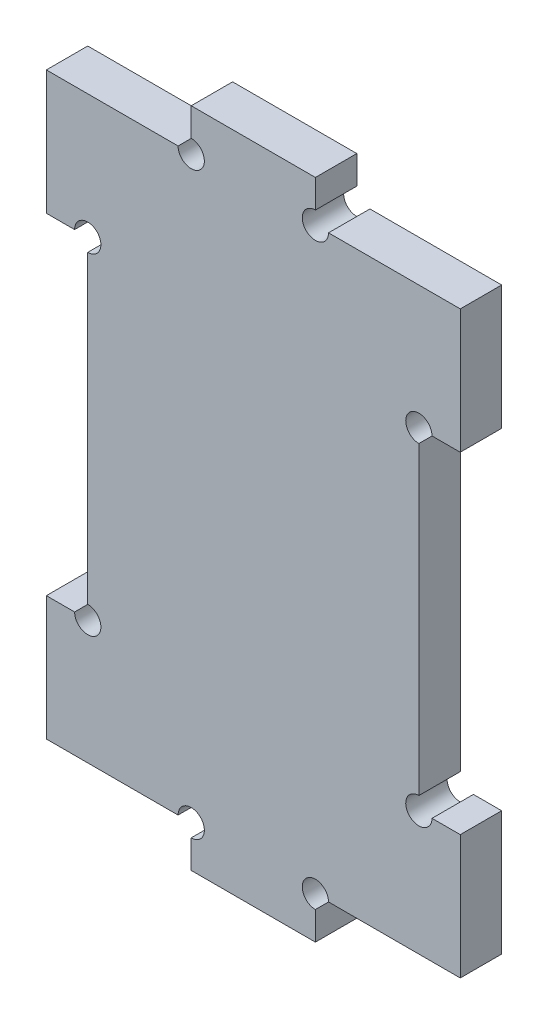
ISO-10303-21;
HEADER;
FILE_DESCRIPTION(('STEP AP214'),'2;1');
FILE_NAME('part.step','',(''),(''),'','','');
FILE_SCHEMA(('AUTOMOTIVE_DESIGN { 1 0 10303 214 1 1 1 1 }'));
ENDSEC;
DATA;
#1=APPLICATION_CONTEXT('core data for automotive mechanical design processes');
#2=APPLICATION_PROTOCOL_DEFINITION('international standard','automotive_design',2000,#1);
#3=PRODUCT_CONTEXT('',#1,'mechanical');
#4=PRODUCT('Part','Part','',(#3));
#5=PRODUCT_RELATED_PRODUCT_CATEGORY('part','',(#4));
#6=PRODUCT_DEFINITION_FORMATION('','',#4);
#7=PRODUCT_DEFINITION_CONTEXT('part definition',#1,'design');
#8=PRODUCT_DEFINITION('design','',#6,#7);
#9=PRODUCT_DEFINITION_SHAPE('','',#8);
#10=(LENGTH_UNIT() NAMED_UNIT(*) SI_UNIT(.MILLI.,.METRE.));
#11=(NAMED_UNIT(*) PLANE_ANGLE_UNIT() SI_UNIT($,.RADIAN.));
#12=(NAMED_UNIT(*) SI_UNIT($,.STERADIAN.) SOLID_ANGLE_UNIT());
#13=UNCERTAINTY_MEASURE_WITH_UNIT(LENGTH_MEASURE(1.E-05),#10,'distance_accuracy_value','');
#14=(GEOMETRIC_REPRESENTATION_CONTEXT(3) GLOBAL_UNCERTAINTY_ASSIGNED_CONTEXT((#13)) GLOBAL_UNIT_ASSIGNED_CONTEXT((#10,
#11,#12)) REPRESENTATION_CONTEXT('',''));
#15=CARTESIAN_POINT('',(0.,0.,0.));
#16=DIRECTION('',(0.,0.,1.));
#17=DIRECTION('',(1.,0.,0.));
#18=AXIS2_PLACEMENT_3D('',#15,#16,#17);
#19=CARTESIAN_POINT('',(25.,35.,5.));
#20=DIRECTION('',(-1.,0.,0.));
#21=DIRECTION('',(0.,0.,1.));
#22=AXIS2_PLACEMENT_3D('',#19,#20,#21);
#23=PLANE('',#22);
#24=DIRECTION('',(0.,0.,1.));
#25=VECTOR('',#24,1.);
#26=CARTESIAN_POINT('',(25.,-20.,0.));
#27=LINE('',#26,#25);
#28=CARTESIAN_POINT('',(25.,-20.,0.));
#29=VERTEX_POINT('',#28);
#30=CARTESIAN_POINT('',(25.,-20.,5.));
#31=VERTEX_POINT('',#30);
#32=EDGE_CURVE('E258',#29,#31,#27,.T.);
#33=ORIENTED_EDGE('',*,*,#32,.T.);
#34=DIRECTION('',(0.,1.,0.));
#35=VECTOR('',#34,1.);
#36=CARTESIAN_POINT('',(25.,35.,5.));
#37=LINE('',#36,#35);
#38=CARTESIAN_POINT('',(25.,-35.,5.));
#39=VERTEX_POINT('',#38);
#40=EDGE_CURVE('E311',#39,#31,#37,.T.);
#41=ORIENTED_EDGE('',*,*,#40,.F.);
#42=DIRECTION('',(0.,0.,-1.));
#43=VECTOR('',#42,1.);
#44=CARTESIAN_POINT('',(25.,-35.,5.));
#45=LINE('',#44,#43);
#46=CARTESIAN_POINT('',(25.,-35.,0.));
#47=VERTEX_POINT('',#46);
#48=EDGE_CURVE('E350',#39,#47,#45,.T.);
#49=ORIENTED_EDGE('',*,*,#48,.T.);
#50=DIRECTION('',(0.,1.,0.));
#51=VECTOR('',#50,1.);
#52=CARTESIAN_POINT('',(25.,35.,0.));
#53=LINE('',#52,#51);
#54=EDGE_CURVE('E343',#47,#29,#53,.T.);
#55=ORIENTED_EDGE('',*,*,#54,.T.);
#56=EDGE_LOOP('',(#33,#41,#49,#55));
#57=FACE_BOUND('',#56,.T.);
#58=ADVANCED_FACE('F33',(#57),#23,.F.);
#59=DIRECTION('',(0.,0.,1.));
#60=VECTOR('',#59,1.);
#61=CARTESIAN_POINT('',(25.,20.,0.));
#62=LINE('',#61,#60);
#63=CARTESIAN_POINT('',(25.,20.,0.));
#64=VERTEX_POINT('',#63);
#65=CARTESIAN_POINT('',(25.,20.,5.));
#66=VERTEX_POINT('',#65);
#67=EDGE_CURVE('E242',#64,#66,#62,.T.);
#68=ORIENTED_EDGE('',*,*,#67,.F.);
#69=CARTESIAN_POINT('',(25.,35.,0.));
#70=VERTEX_POINT('',#69);
#71=EDGE_CURVE('E342',#64,#70,#53,.T.);
#72=ORIENTED_EDGE('',*,*,#71,.T.);
#73=DIRECTION('',(0.,0.,-1.));
#74=VECTOR('',#73,1.);
#75=CARTESIAN_POINT('',(25.,35.,5.));
#76=LINE('',#75,#74);
#77=CARTESIAN_POINT('',(25.,35.,5.));
#78=VERTEX_POINT('',#77);
#79=EDGE_CURVE('E317',#78,#70,#76,.T.);
#80=ORIENTED_EDGE('',*,*,#79,.F.);
#81=EDGE_CURVE('E310',#66,#78,#37,.T.);
#82=ORIENTED_EDGE('',*,*,#81,.F.);
#83=EDGE_LOOP('',(#68,#72,#80,#82));
#84=FACE_BOUND('',#83,.T.);
#85=ADVANCED_FACE('F488',(#84),#23,.F.);
#86=CARTESIAN_POINT('',(0.,0.,5.));
#87=DIRECTION('',(0.,0.,1.));
#88=DIRECTION('',(1.,0.,0.));
#89=AXIS2_PLACEMENT_3D('',#86,#87,#88);
#90=PLANE('',#89);
#91=CARTESIAN_POINT('',(7.5,35.,5.));
#92=DIRECTION('',(0.,0.,1.));
#93=DIRECTION('',(1.,0.,0.));
#94=AXIS2_PLACEMENT_3D('',#91,#92,#93);
#95=CIRCLE('',#94,1.5875);
#96=CARTESIAN_POINT('',(7.5,36.5875,5.));
#97=VERTEX_POINT('',#96);
#98=CARTESIAN_POINT('',(9.0875,35.,5.));
#99=VERTEX_POINT('',#98);
#100=EDGE_CURVE('E426',#97,#99,#95,.T.);
#101=ORIENTED_EDGE('',*,*,#100,.F.);
#102=DIRECTION('',(0.,1.,0.));
#103=VECTOR('',#102,1.);
#104=CARTESIAN_POINT('',(7.5,40.,5.));
#105=LINE('',#104,#103);
#106=CARTESIAN_POINT('',(7.5,40.,5.));
#107=VERTEX_POINT('',#106);
#108=EDGE_CURVE('E284',#97,#107,#105,.T.);
#109=ORIENTED_EDGE('',*,*,#108,.T.);
#110=DIRECTION('',(-1.,0.,0.));
#111=VECTOR('',#110,1.);
#112=CARTESIAN_POINT('',(-7.5,40.,5.));
#113=LINE('',#112,#111);
#114=CARTESIAN_POINT('',(-7.5,40.,5.));
#115=VERTEX_POINT('',#114);
#116=EDGE_CURVE('E286',#107,#115,#113,.T.);
#117=ORIENTED_EDGE('',*,*,#116,.T.);
#118=DIRECTION('',(0.,-1.,0.));
#119=VECTOR('',#118,1.);
#120=CARTESIAN_POINT('',(-7.5,40.,5.));
#121=LINE('',#120,#119);
#122=CARTESIAN_POINT('',(-7.5,36.5875,5.));
#123=VERTEX_POINT('',#122);
#124=EDGE_CURVE('E289',#115,#123,#121,.T.);
#125=ORIENTED_EDGE('',*,*,#124,.T.);
#126=CARTESIAN_POINT('',(-7.5,35.,5.));
#127=DIRECTION('',(0.,0.,1.));
#128=DIRECTION('',(1.,0.,0.));
#129=AXIS2_PLACEMENT_3D('',#126,#127,#128);
#130=CIRCLE('',#129,1.5875);
#131=CARTESIAN_POINT('',(-9.0875,35.,5.));
#132=VERTEX_POINT('',#131);
#133=EDGE_CURVE('E425',#132,#123,#130,.T.);
#134=ORIENTED_EDGE('',*,*,#133,.F.);
#135=DIRECTION('',(-1.,0.,0.));
#136=VECTOR('',#135,1.);
#137=CARTESIAN_POINT('',(-7.5,35.,5.));
#138=LINE('',#137,#136);
#139=CARTESIAN_POINT('',(-25.,35.,5.));
#140=VERTEX_POINT('',#139);
#141=EDGE_CURVE('E292',#132,#140,#138,.T.);
#142=ORIENTED_EDGE('',*,*,#141,.T.);
#143=DIRECTION('',(0.,-1.,0.));
#144=VECTOR('',#143,1.);
#145=CARTESIAN_POINT('',(-25.,35.,5.));
#146=LINE('',#145,#144);
#147=CARTESIAN_POINT('',(-25.,20.,5.));
#148=VERTEX_POINT('',#147);
#149=EDGE_CURVE('E295',#140,#148,#146,.T.);
#150=ORIENTED_EDGE('',*,*,#149,.T.);
#151=DIRECTION('',(-1.,0.,0.));
#152=VECTOR('',#151,1.);
#153=CARTESIAN_POINT('',(-20.,20.,5.));
#154=LINE('',#153,#152);
#155=CARTESIAN_POINT('',(-21.5875,20.,5.));
#156=VERTEX_POINT('',#155);
#157=EDGE_CURVE('E267',#156,#148,#154,.T.);
#158=ORIENTED_EDGE('',*,*,#157,.F.);
#159=CARTESIAN_POINT('',(-20.,20.,5.));
#160=DIRECTION('',(0.,0.,1.));
#161=DIRECTION('',(1.,0.,0.));
#162=AXIS2_PLACEMENT_3D('',#159,#160,#161);
#163=CIRCLE('',#162,1.5875);
#164=CARTESIAN_POINT('',(-20.,18.4125,5.));
#165=VERTEX_POINT('',#164);
#166=EDGE_CURVE('E431',#165,#156,#163,.T.);
#167=ORIENTED_EDGE('',*,*,#166,.F.);
#168=DIRECTION('',(0.,1.,0.));
#169=VECTOR('',#168,1.);
#170=CARTESIAN_POINT('',(-20.,-20.,5.));
#171=LINE('',#170,#169);
#172=CARTESIAN_POINT('',(-20.,-18.4125,5.));
#173=VERTEX_POINT('',#172);
#174=EDGE_CURVE('E275',#173,#165,#171,.T.);
#175=ORIENTED_EDGE('',*,*,#174,.F.);
#176=CARTESIAN_POINT('',(-20.,-20.,5.));
#177=DIRECTION('',(0.,0.,1.));
#178=DIRECTION('',(1.,0.,0.));
#179=AXIS2_PLACEMENT_3D('',#176,#177,#178);
#180=CIRCLE('',#179,1.5875);
#181=CARTESIAN_POINT('',(-21.5875,-20.,5.));
#182=VERTEX_POINT('',#181);
#183=EDGE_CURVE('E412',#182,#173,#180,.T.);
#184=ORIENTED_EDGE('',*,*,#183,.F.);
#185=DIRECTION('',(1.,0.,0.));
#186=VECTOR('',#185,1.);
#187=CARTESIAN_POINT('',(-20.,-20.,5.));
#188=LINE('',#187,#186);
#189=CARTESIAN_POINT('',(-25.,-20.,5.));
#190=VERTEX_POINT('',#189);
#191=EDGE_CURVE('E261',#190,#182,#188,.T.);
#192=ORIENTED_EDGE('',*,*,#191,.F.);
#193=CARTESIAN_POINT('',(-25.,-35.,5.));
#194=VERTEX_POINT('',#193);
#195=EDGE_CURVE('E294',#190,#194,#146,.T.);
#196=ORIENTED_EDGE('',*,*,#195,.T.);
#197=DIRECTION('',(1.,0.,0.));
#198=VECTOR('',#197,1.);
#199=CARTESIAN_POINT('',(-7.5,-35.,5.));
#200=LINE('',#199,#198);
#201=CARTESIAN_POINT('',(-9.0875,-35.,5.));
#202=VERTEX_POINT('',#201);
#203=EDGE_CURVE('E298',#194,#202,#200,.T.);
#204=ORIENTED_EDGE('',*,*,#203,.T.);
#205=CARTESIAN_POINT('',(-7.5,-35.,5.));
#206=DIRECTION('',(0.,0.,1.));
#207=DIRECTION('',(1.,0.,0.));
#208=AXIS2_PLACEMENT_3D('',#205,#206,#207);
#209=CIRCLE('',#208,1.5875);
#210=CARTESIAN_POINT('',(-7.5,-36.5875,5.));
#211=VERTEX_POINT('',#210);
#212=EDGE_CURVE('E407',#211,#202,#209,.T.);
#213=ORIENTED_EDGE('',*,*,#212,.F.);
#214=DIRECTION('',(0.,-1.,0.));
#215=VECTOR('',#214,1.);
#216=CARTESIAN_POINT('',(-7.5,-40.,5.));
#217=LINE('',#216,#215);
#218=CARTESIAN_POINT('',(-7.5,-40.,5.));
#219=VERTEX_POINT('',#218);
#220=EDGE_CURVE('E301',#211,#219,#217,.T.);
#221=ORIENTED_EDGE('',*,*,#220,.T.);
#222=DIRECTION('',(1.,0.,0.));
#223=VECTOR('',#222,1.);
#224=CARTESIAN_POINT('',(-7.5,-40.,5.));
#225=LINE('',#224,#223);
#226=CARTESIAN_POINT('',(7.5,-40.,5.));
#227=VERTEX_POINT('',#226);
#228=EDGE_CURVE('E303',#219,#227,#225,.T.);
#229=ORIENTED_EDGE('',*,*,#228,.T.);
#230=DIRECTION('',(0.,1.,0.));
#231=VECTOR('',#230,1.);
#232=CARTESIAN_POINT('',(7.5,-40.,5.));
#233=LINE('',#232,#231);
#234=CARTESIAN_POINT('',(7.5,-36.5875,5.));
#235=VERTEX_POINT('',#234);
#236=EDGE_CURVE('E305',#227,#235,#233,.T.);
#237=ORIENTED_EDGE('',*,*,#236,.T.);
#238=CARTESIAN_POINT('',(7.5,-35.,5.));
#239=DIRECTION('',(0.,0.,1.));
#240=DIRECTION('',(1.,0.,0.));
#241=AXIS2_PLACEMENT_3D('',#238,#239,#240);
#242=CIRCLE('',#241,1.5875);
#243=CARTESIAN_POINT('',(9.0875,-35.,5.));
#244=VERTEX_POINT('',#243);
#245=EDGE_CURVE('E405',#244,#235,#242,.T.);
#246=ORIENTED_EDGE('',*,*,#245,.F.);
#247=DIRECTION('',(1.,0.,0.));
#248=VECTOR('',#247,1.);
#249=CARTESIAN_POINT('',(7.5,-35.,5.));
#250=LINE('',#249,#248);
#251=EDGE_CURVE('E308',#244,#39,#250,.T.);
#252=ORIENTED_EDGE('',*,*,#251,.T.);
#253=ORIENTED_EDGE('',*,*,#40,.T.);
#254=DIRECTION('',(-1.,0.,0.));
#255=VECTOR('',#254,1.);
#256=CARTESIAN_POINT('',(20.,-20.,5.));
#257=LINE('',#256,#255);
#258=CARTESIAN_POINT('',(21.5875,-20.,5.));
#259=VERTEX_POINT('',#258);
#260=EDGE_CURVE('E246',#31,#259,#257,.T.);
#261=ORIENTED_EDGE('',*,*,#260,.T.);
#262=CARTESIAN_POINT('',(20.,-20.,5.));
#263=DIRECTION('',(0.,0.,1.));
#264=DIRECTION('',(1.,0.,0.));
#265=AXIS2_PLACEMENT_3D('',#262,#263,#264);
#266=CIRCLE('',#265,1.5875);
#267=CARTESIAN_POINT('',(20.,-18.4125,5.));
#268=VERTEX_POINT('',#267);
#269=EDGE_CURVE('E420',#268,#259,#266,.T.);
#270=ORIENTED_EDGE('',*,*,#269,.F.);
#271=DIRECTION('',(0.,1.,0.));
#272=VECTOR('',#271,1.);
#273=CARTESIAN_POINT('',(20.,-20.,5.));
#274=LINE('',#273,#272);
#275=CARTESIAN_POINT('',(20.,18.4125,5.));
#276=VERTEX_POINT('',#275);
#277=EDGE_CURVE('E237',#268,#276,#274,.T.);
#278=ORIENTED_EDGE('',*,*,#277,.T.);
#279=CARTESIAN_POINT('',(20.,20.,5.));
#280=DIRECTION('',(0.,0.,1.));
#281=DIRECTION('',(1.,0.,0.));
#282=AXIS2_PLACEMENT_3D('',#279,#280,#281);
#283=CIRCLE('',#282,1.5875);
#284=CARTESIAN_POINT('',(21.5875,20.,5.));
#285=VERTEX_POINT('',#284);
#286=EDGE_CURVE('E219',#285,#276,#283,.T.);
#287=ORIENTED_EDGE('',*,*,#286,.F.);
#288=DIRECTION('',(1.,0.,0.));
#289=VECTOR('',#288,1.);
#290=CARTESIAN_POINT('',(20.,20.,5.));
#291=LINE('',#290,#289);
#292=EDGE_CURVE('E233',#285,#66,#291,.T.);
#293=ORIENTED_EDGE('',*,*,#292,.T.);
#294=ORIENTED_EDGE('',*,*,#81,.T.);
#295=DIRECTION('',(-1.,0.,0.));
#296=VECTOR('',#295,1.);
#297=CARTESIAN_POINT('',(7.5,35.,5.));
#298=LINE('',#297,#296);
#299=EDGE_CURVE('E314',#78,#99,#298,.T.);
#300=ORIENTED_EDGE('',*,*,#299,.T.);
#301=EDGE_LOOP('',(#101,#109,#117,#125,#134,#142,#150,#158,#167,#175,#184,#192,#196,#204,#213,
#221,#229,#237,#246,#252,#253,#261,#270,#278,#287,#293,#294,#300));
#302=FACE_BOUND('',#301,.T.);
#303=ADVANCED_FACE('F232',(#302),#90,.T.);
#304=CARTESIAN_POINT('',(0.,0.,0.));
#305=DIRECTION('',(0.,0.,1.));
#306=DIRECTION('',(1.,0.,0.));
#307=AXIS2_PLACEMENT_3D('',#304,#305,#306);
#308=PLANE('',#307);
#309=DIRECTION('',(0.,1.,0.));
#310=VECTOR('',#309,1.);
#311=CARTESIAN_POINT('',(7.5,40.,0.));
#312=LINE('',#311,#310);
#313=CARTESIAN_POINT('',(7.5,36.5875,0.));
#314=VERTEX_POINT('',#313);
#315=CARTESIAN_POINT('',(7.5,40.,0.));
#316=VERTEX_POINT('',#315);
#317=EDGE_CURVE('E282',#314,#316,#312,.T.);
#318=ORIENTED_EDGE('',*,*,#317,.F.);
#319=CARTESIAN_POINT('',(7.5,35.,0.));
#320=DIRECTION('',(0.,0.,1.));
#321=DIRECTION('',(1.,0.,0.));
#322=AXIS2_PLACEMENT_3D('',#319,#320,#321);
#323=CIRCLE('',#322,1.5875);
#324=CARTESIAN_POINT('',(9.0875,35.,0.));
#325=VERTEX_POINT('',#324);
#326=EDGE_CURVE('E422',#314,#325,#323,.T.);
#327=ORIENTED_EDGE('',*,*,#326,.T.);
#328=DIRECTION('',(-1.,0.,0.));
#329=VECTOR('',#328,1.);
#330=CARTESIAN_POINT('',(7.5,35.,0.));
#331=LINE('',#330,#329);
#332=EDGE_CURVE('E287',#70,#325,#331,.T.);
#333=ORIENTED_EDGE('',*,*,#332,.F.);
#334=ORIENTED_EDGE('',*,*,#71,.F.);
#335=DIRECTION('',(1.,0.,0.));
#336=VECTOR('',#335,1.);
#337=CARTESIAN_POINT('',(20.,20.,0.));
#338=LINE('',#337,#336);
#339=CARTESIAN_POINT('',(21.5875,20.,0.));
#340=VERTEX_POINT('',#339);
#341=EDGE_CURVE('E257',#340,#64,#338,.T.);
#342=ORIENTED_EDGE('',*,*,#341,.F.);
#343=CARTESIAN_POINT('',(20.,20.,0.));
#344=DIRECTION('',(0.,0.,1.));
#345=DIRECTION('',(1.,0.,0.));
#346=AXIS2_PLACEMENT_3D('',#343,#344,#345);
#347=CIRCLE('',#346,1.5875);
#348=CARTESIAN_POINT('',(20.,18.4125,0.));
#349=VERTEX_POINT('',#348);
#350=EDGE_CURVE('E222',#340,#349,#347,.T.);
#351=ORIENTED_EDGE('',*,*,#350,.T.);
#352=DIRECTION('',(0.,1.,0.));
#353=VECTOR('',#352,1.);
#354=CARTESIAN_POINT('',(20.,-20.,0.));
#355=LINE('',#354,#353);
#356=CARTESIAN_POINT('',(20.,-18.4125,0.));
#357=VERTEX_POINT('',#356);
#358=EDGE_CURVE('E454',#357,#349,#355,.T.);
#359=ORIENTED_EDGE('',*,*,#358,.F.);
#360=CARTESIAN_POINT('',(20.,-20.,0.));
#361=DIRECTION('',(0.,0.,1.));
#362=DIRECTION('',(1.,0.,0.));
#363=AXIS2_PLACEMENT_3D('',#360,#361,#362);
#364=CIRCLE('',#363,1.5875);
#365=CARTESIAN_POINT('',(21.5875,-20.,0.));
#366=VERTEX_POINT('',#365);
#367=EDGE_CURVE('E417',#357,#366,#364,.T.);
#368=ORIENTED_EDGE('',*,*,#367,.T.);
#369=DIRECTION('',(-1.,0.,0.));
#370=VECTOR('',#369,1.);
#371=CARTESIAN_POINT('',(20.,-20.,0.));
#372=LINE('',#371,#370);
#373=EDGE_CURVE('E252',#29,#366,#372,.T.);
#374=ORIENTED_EDGE('',*,*,#373,.F.);
#375=ORIENTED_EDGE('',*,*,#54,.F.);
#376=DIRECTION('',(1.,0.,0.));
#377=VECTOR('',#376,1.);
#378=CARTESIAN_POINT('',(7.5,-35.,0.));
#379=LINE('',#378,#377);
#380=CARTESIAN_POINT('',(9.0875,-35.,0.));
#381=VERTEX_POINT('',#380);
#382=EDGE_CURVE('E340',#381,#47,#379,.T.);
#383=ORIENTED_EDGE('',*,*,#382,.F.);
#384=CARTESIAN_POINT('',(7.5,-35.,0.));
#385=DIRECTION('',(0.,0.,1.));
#386=DIRECTION('',(1.,0.,0.));
#387=AXIS2_PLACEMENT_3D('',#384,#385,#386);
#388=CIRCLE('',#387,1.5875);
#389=CARTESIAN_POINT('',(7.5,-36.5875,0.));
#390=VERTEX_POINT('',#389);
#391=EDGE_CURVE('E410',#381,#390,#388,.T.);
#392=ORIENTED_EDGE('',*,*,#391,.T.);
#393=DIRECTION('',(0.,1.,0.));
#394=VECTOR('',#393,1.);
#395=CARTESIAN_POINT('',(7.5,-40.,0.));
#396=LINE('',#395,#394);
#397=CARTESIAN_POINT('',(7.5,-40.,0.));
#398=VERTEX_POINT('',#397);
#399=EDGE_CURVE('E337',#398,#390,#396,.T.);
#400=ORIENTED_EDGE('',*,*,#399,.F.);
#401=DIRECTION('',(1.,0.,0.));
#402=VECTOR('',#401,1.);
#403=CARTESIAN_POINT('',(-7.5,-40.,0.));
#404=LINE('',#403,#402);
#405=CARTESIAN_POINT('',(-7.5,-40.,0.));
#406=VERTEX_POINT('',#405);
#407=EDGE_CURVE('E335',#406,#398,#404,.T.);
#408=ORIENTED_EDGE('',*,*,#407,.F.);
#409=DIRECTION('',(0.,-1.,0.));
#410=VECTOR('',#409,1.);
#411=CARTESIAN_POINT('',(-7.5,-40.,0.));
#412=LINE('',#411,#410);
#413=CARTESIAN_POINT('',(-7.5,-36.5875,0.));
#414=VERTEX_POINT('',#413);
#415=EDGE_CURVE('E333',#414,#406,#412,.T.);
#416=ORIENTED_EDGE('',*,*,#415,.F.);
#417=CARTESIAN_POINT('',(-7.5,-35.,0.));
#418=DIRECTION('',(0.,0.,1.));
#419=DIRECTION('',(1.,0.,0.));
#420=AXIS2_PLACEMENT_3D('',#417,#418,#419);
#421=CIRCLE('',#420,1.5875);
#422=CARTESIAN_POINT('',(-9.0875,-35.,0.));
#423=VERTEX_POINT('',#422);
#424=EDGE_CURVE('E55',#414,#423,#421,.T.);
#425=ORIENTED_EDGE('',*,*,#424,.T.);
#426=DIRECTION('',(1.,0.,0.));
#427=VECTOR('',#426,1.);
#428=CARTESIAN_POINT('',(-7.5,-35.,0.));
#429=LINE('',#428,#427);
#430=CARTESIAN_POINT('',(-25.,-35.,0.));
#431=VERTEX_POINT('',#430);
#432=EDGE_CURVE('E330',#431,#423,#429,.T.);
#433=ORIENTED_EDGE('',*,*,#432,.F.);
#434=DIRECTION('',(0.,-1.,0.));
#435=VECTOR('',#434,1.);
#436=CARTESIAN_POINT('',(-25.,35.,0.));
#437=LINE('',#436,#435);
#438=CARTESIAN_POINT('',(-25.,-20.,0.));
#439=VERTEX_POINT('',#438);
#440=EDGE_CURVE('E326',#439,#431,#437,.T.);
#441=ORIENTED_EDGE('',*,*,#440,.F.);
#442=DIRECTION('',(1.,0.,0.));
#443=VECTOR('',#442,1.);
#444=CARTESIAN_POINT('',(-20.,-20.,0.));
#445=LINE('',#444,#443);
#446=CARTESIAN_POINT('',(-21.5875,-20.,0.));
#447=VERTEX_POINT('',#446);
#448=EDGE_CURVE('E263',#439,#447,#445,.T.);
#449=ORIENTED_EDGE('',*,*,#448,.T.);
#450=CARTESIAN_POINT('',(-20.,-20.,0.));
#451=DIRECTION('',(0.,0.,1.));
#452=DIRECTION('',(1.,0.,0.));
#453=AXIS2_PLACEMENT_3D('',#450,#451,#452);
#454=CIRCLE('',#453,1.5875);
#455=CARTESIAN_POINT('',(-20.,-18.4125,0.));
#456=VERTEX_POINT('',#455);
#457=EDGE_CURVE('E433',#447,#456,#454,.T.);
#458=ORIENTED_EDGE('',*,*,#457,.T.);
#459=DIRECTION('',(0.,1.,0.));
#460=VECTOR('',#459,1.);
#461=CARTESIAN_POINT('',(-20.,-20.,0.));
#462=LINE('',#461,#460);
#463=CARTESIAN_POINT('',(-20.,18.4125,0.));
#464=VERTEX_POINT('',#463);
#465=EDGE_CURVE('E266',#456,#464,#462,.T.);
#466=ORIENTED_EDGE('',*,*,#465,.T.);
#467=CARTESIAN_POINT('',(-20.,20.,0.));
#468=DIRECTION('',(0.,0.,1.));
#469=DIRECTION('',(1.,0.,0.));
#470=AXIS2_PLACEMENT_3D('',#467,#468,#469);
#471=CIRCLE('',#470,1.5875);
#472=CARTESIAN_POINT('',(-21.5875,20.,0.));
#473=VERTEX_POINT('',#472);
#474=EDGE_CURVE('E238',#464,#473,#471,.T.);
#475=ORIENTED_EDGE('',*,*,#474,.T.);
#476=DIRECTION('',(-1.,0.,0.));
#477=VECTOR('',#476,1.);
#478=CARTESIAN_POINT('',(-20.,20.,0.));
#479=LINE('',#478,#477);
#480=CARTESIAN_POINT('',(-25.,20.,0.));
#481=VERTEX_POINT('',#480);
#482=EDGE_CURVE('E270',#473,#481,#479,.T.);
#483=ORIENTED_EDGE('',*,*,#482,.T.);
#484=CARTESIAN_POINT('',(-25.,35.,0.));
#485=VERTEX_POINT('',#484);
#486=EDGE_CURVE('E327',#485,#481,#437,.T.);
#487=ORIENTED_EDGE('',*,*,#486,.F.);
#488=DIRECTION('',(-1.,0.,0.));
#489=VECTOR('',#488,1.);
#490=CARTESIAN_POINT('',(-7.5,35.,0.));
#491=LINE('',#490,#489);
#492=CARTESIAN_POINT('',(-9.0875,35.,0.));
#493=VERTEX_POINT('',#492);
#494=EDGE_CURVE('E324',#493,#485,#491,.T.);
#495=ORIENTED_EDGE('',*,*,#494,.F.);
#496=CARTESIAN_POINT('',(-7.5,35.,0.));
#497=DIRECTION('',(0.,0.,1.));
#498=DIRECTION('',(1.,0.,0.));
#499=AXIS2_PLACEMENT_3D('',#496,#497,#498);
#500=CIRCLE('',#499,1.5875);
#501=CARTESIAN_POINT('',(-7.5,36.5875,0.));
#502=VERTEX_POINT('',#501);
#503=EDGE_CURVE('E48',#493,#502,#500,.T.);
#504=ORIENTED_EDGE('',*,*,#503,.T.);
#505=DIRECTION('',(0.,-1.,0.));
#506=VECTOR('',#505,1.);
#507=CARTESIAN_POINT('',(-7.5,40.,0.));
#508=LINE('',#507,#506);
#509=CARTESIAN_POINT('',(-7.5,40.,0.));
#510=VERTEX_POINT('',#509);
#511=EDGE_CURVE('E321',#510,#502,#508,.T.);
#512=ORIENTED_EDGE('',*,*,#511,.F.);
#513=DIRECTION('',(-1.,0.,0.));
#514=VECTOR('',#513,1.);
#515=CARTESIAN_POINT('',(-7.5,40.,0.));
#516=LINE('',#515,#514);
#517=EDGE_CURVE('E319',#316,#510,#516,.T.);
#518=ORIENTED_EDGE('',*,*,#517,.F.);
#519=EDGE_LOOP('',(#318,#327,#333,#334,#342,#351,#359,#368,#374,#375,#383,#392,#400,#408,#416,
#425,#433,#441,#449,#458,#466,#475,#483,#487,#495,#504,#512,#518));
#520=FACE_BOUND('',#519,.T.);
#521=ADVANCED_FACE('F391',(#520),#308,.F.);
#522=CARTESIAN_POINT('',(-25.,35.,5.));
#523=DIRECTION('',(1.,0.,0.));
#524=DIRECTION('',(0.,0.,-1.));
#525=AXIS2_PLACEMENT_3D('',#522,#523,#524);
#526=PLANE('',#525);
#527=ORIENTED_EDGE('',*,*,#486,.T.);
#528=DIRECTION('',(0.,0.,1.));
#529=VECTOR('',#528,1.);
#530=CARTESIAN_POINT('',(-25.,20.,0.));
#531=LINE('',#530,#529);
#532=EDGE_CURVE('E279',#481,#148,#531,.T.);
#533=ORIENTED_EDGE('',*,*,#532,.T.);
#534=ORIENTED_EDGE('',*,*,#149,.F.);
#535=DIRECTION('',(0.,0.,-1.));
#536=VECTOR('',#535,1.);
#537=CARTESIAN_POINT('',(-25.,35.,5.));
#538=LINE('',#537,#536);
#539=EDGE_CURVE('E362',#140,#485,#538,.T.);
#540=ORIENTED_EDGE('',*,*,#539,.T.);
#541=EDGE_LOOP('',(#527,#533,#534,#540));
#542=FACE_BOUND('',#541,.T.);
#543=ADVANCED_FACE('F515',(#542),#526,.F.);
#544=CARTESIAN_POINT('',(7.5,40.,5.));
#545=DIRECTION('',(-1.,0.,0.));
#546=DIRECTION('',(0.,-1.,0.));
#547=AXIS2_PLACEMENT_3D('',#544,#545,#546);
#548=PLANE('',#547);
#549=ORIENTED_EDGE('',*,*,#108,.F.);
#550=DIRECTION('',(0.,0.,1.));
#551=VECTOR('',#550,1.);
#552=CARTESIAN_POINT('',(7.5,36.5875,0.));
#553=LINE('',#552,#551);
#554=EDGE_CURVE('E449',#97,#314,#553,.F.);
#555=ORIENTED_EDGE('',*,*,#554,.T.);
#556=ORIENTED_EDGE('',*,*,#317,.T.);
#557=DIRECTION('',(0.,0.,-1.));
#558=VECTOR('',#557,1.);
#559=CARTESIAN_POINT('',(7.5,40.,5.));
#560=LINE('',#559,#558);
#561=EDGE_CURVE('E227',#107,#316,#560,.T.);
#562=ORIENTED_EDGE('',*,*,#561,.F.);
#563=EDGE_LOOP('',(#549,#555,#556,#562));
#564=FACE_BOUND('',#563,.T.);
#565=ADVANCED_FACE('F35',(#564),#548,.F.);
#566=CARTESIAN_POINT('',(-7.5,40.,5.));
#567=DIRECTION('',(0.,-1.,0.));
#568=DIRECTION('',(0.,0.,-1.));
#569=AXIS2_PLACEMENT_3D('',#566,#567,#568);
#570=PLANE('',#569);
#571=ORIENTED_EDGE('',*,*,#517,.T.);
#572=DIRECTION('',(0.,0.,-1.));
#573=VECTOR('',#572,1.);
#574=CARTESIAN_POINT('',(-7.5,40.,5.));
#575=LINE('',#574,#573);
#576=EDGE_CURVE('E365',#115,#510,#575,.T.);
#577=ORIENTED_EDGE('',*,*,#576,.F.);
#578=ORIENTED_EDGE('',*,*,#116,.F.);
#579=ORIENTED_EDGE('',*,*,#561,.T.);
#580=EDGE_LOOP('',(#571,#577,#578,#579));
#581=FACE_BOUND('',#580,.T.);
#582=ADVANCED_FACE('F521',(#581),#570,.F.);
#583=CARTESIAN_POINT('',(-7.5,40.,5.));
#584=DIRECTION('',(1.,0.,0.));
#585=DIRECTION('',(0.,1.,0.));
#586=AXIS2_PLACEMENT_3D('',#583,#584,#585);
#587=PLANE('',#586);
#588=ORIENTED_EDGE('',*,*,#511,.T.);
#589=DIRECTION('',(0.,0.,1.));
#590=VECTOR('',#589,1.);
#591=CARTESIAN_POINT('',(-7.5,36.5875,0.));
#592=LINE('',#591,#590);
#593=EDGE_CURVE('E244',#502,#123,#592,.T.);
#594=ORIENTED_EDGE('',*,*,#593,.T.);
#595=ORIENTED_EDGE('',*,*,#124,.F.);
#596=ORIENTED_EDGE('',*,*,#576,.T.);
#597=EDGE_LOOP('',(#588,#594,#595,#596));
#598=FACE_BOUND('',#597,.T.);
#599=ADVANCED_FACE('F518',(#598),#587,.F.);
#600=CARTESIAN_POINT('',(-7.5,35.,5.));
#601=DIRECTION('',(0.,-1.,0.));
#602=DIRECTION('',(1.,0.,0.));
#603=AXIS2_PLACEMENT_3D('',#600,#601,#602);
#604=PLANE('',#603);
#605=ORIENTED_EDGE('',*,*,#141,.F.);
#606=DIRECTION('',(0.,0.,1.));
#607=VECTOR('',#606,1.);
#608=CARTESIAN_POINT('',(-9.0875,35.,0.));
#609=LINE('',#608,#607);
#610=EDGE_CURVE('E11',#132,#493,#609,.F.);
#611=ORIENTED_EDGE('',*,*,#610,.T.);
#612=ORIENTED_EDGE('',*,*,#494,.T.);
#613=ORIENTED_EDGE('',*,*,#539,.F.);
#614=EDGE_LOOP('',(#605,#611,#612,#613));
#615=FACE_BOUND('',#614,.T.);
#616=ADVANCED_FACE('F513',(#615),#604,.F.);
#617=ORIENTED_EDGE('',*,*,#195,.F.);
#618=DIRECTION('',(0.,0.,1.));
#619=VECTOR('',#618,1.);
#620=CARTESIAN_POINT('',(-25.,-20.,0.));
#621=LINE('',#620,#619);
#622=EDGE_CURVE('E272',#439,#190,#621,.T.);
#623=ORIENTED_EDGE('',*,*,#622,.F.);
#624=ORIENTED_EDGE('',*,*,#440,.T.);
#625=DIRECTION('',(0.,0.,-1.));
#626=VECTOR('',#625,1.);
#627=CARTESIAN_POINT('',(-25.,-35.,5.));
#628=LINE('',#627,#626);
#629=EDGE_CURVE('E359',#194,#431,#628,.T.);
#630=ORIENTED_EDGE('',*,*,#629,.F.);
#631=EDGE_LOOP('',(#617,#623,#624,#630));
#632=FACE_BOUND('',#631,.T.);
#633=ADVANCED_FACE('F509',(#632),#526,.F.);
#634=CARTESIAN_POINT('',(-7.5,-35.,5.));
#635=DIRECTION('',(0.,1.,0.));
#636=DIRECTION('',(-1.,0.,0.));
#637=AXIS2_PLACEMENT_3D('',#634,#635,#636);
#638=PLANE('',#637);
#639=ORIENTED_EDGE('',*,*,#432,.T.);
#640=DIRECTION('',(0.,0.,1.));
#641=VECTOR('',#640,1.);
#642=CARTESIAN_POINT('',(-9.0875,-35.,0.));
#643=LINE('',#642,#641);
#644=EDGE_CURVE('E249',#423,#202,#643,.T.);
#645=ORIENTED_EDGE('',*,*,#644,.T.);
#646=ORIENTED_EDGE('',*,*,#203,.F.);
#647=ORIENTED_EDGE('',*,*,#629,.T.);
#648=EDGE_LOOP('',(#639,#645,#646,#647));
#649=FACE_BOUND('',#648,.T.);
#650=ADVANCED_FACE('F506',(#649),#638,.F.);
#651=CARTESIAN_POINT('',(-7.5,-40.,5.));
#652=DIRECTION('',(1.,0.,0.));
#653=DIRECTION('',(0.,1.,0.));
#654=AXIS2_PLACEMENT_3D('',#651,#652,#653);
#655=PLANE('',#654);
#656=ORIENTED_EDGE('',*,*,#220,.F.);
#657=DIRECTION('',(0.,0.,1.));
#658=VECTOR('',#657,1.);
#659=CARTESIAN_POINT('',(-7.5,-36.5875,0.));
#660=LINE('',#659,#658);
#661=EDGE_CURVE('E41',#211,#414,#660,.F.);
#662=ORIENTED_EDGE('',*,*,#661,.T.);
#663=ORIENTED_EDGE('',*,*,#415,.T.);
#664=DIRECTION('',(0.,0.,-1.));
#665=VECTOR('',#664,1.);
#666=CARTESIAN_POINT('',(-7.5,-40.,5.));
#667=LINE('',#666,#665);
#668=EDGE_CURVE('E356',#219,#406,#667,.T.);
#669=ORIENTED_EDGE('',*,*,#668,.F.);
#670=EDGE_LOOP('',(#656,#662,#663,#669));
#671=FACE_BOUND('',#670,.T.);
#672=ADVANCED_FACE('F385',(#671),#655,.F.);
#673=CARTESIAN_POINT('',(-7.5,-40.,5.));
#674=DIRECTION('',(0.,1.,0.));
#675=DIRECTION('',(0.,0.,1.));
#676=AXIS2_PLACEMENT_3D('',#673,#674,#675);
#677=PLANE('',#676);
#678=ORIENTED_EDGE('',*,*,#407,.T.);
#679=DIRECTION('',(0.,0.,-1.));
#680=VECTOR('',#679,1.);
#681=CARTESIAN_POINT('',(7.5,-40.,5.));
#682=LINE('',#681,#680);
#683=EDGE_CURVE('E353',#227,#398,#682,.T.);
#684=ORIENTED_EDGE('',*,*,#683,.F.);
#685=ORIENTED_EDGE('',*,*,#228,.F.);
#686=ORIENTED_EDGE('',*,*,#668,.T.);
#687=EDGE_LOOP('',(#678,#684,#685,#686));
#688=FACE_BOUND('',#687,.T.);
#689=ADVANCED_FACE('F397',(#688),#677,.F.);
#690=CARTESIAN_POINT('',(7.5,-40.,5.));
#691=DIRECTION('',(-1.,0.,0.));
#692=DIRECTION('',(0.,-1.,0.));
#693=AXIS2_PLACEMENT_3D('',#690,#691,#692);
#694=PLANE('',#693);
#695=ORIENTED_EDGE('',*,*,#399,.T.);
#696=DIRECTION('',(0.,0.,1.));
#697=VECTOR('',#696,1.);
#698=CARTESIAN_POINT('',(7.5,-36.5875,0.));
#699=LINE('',#698,#697);
#700=EDGE_CURVE('E403',#390,#235,#699,.T.);
#701=ORIENTED_EDGE('',*,*,#700,.T.);
#702=ORIENTED_EDGE('',*,*,#236,.F.);
#703=ORIENTED_EDGE('',*,*,#683,.T.);
#704=EDGE_LOOP('',(#695,#701,#702,#703));
#705=FACE_BOUND('',#704,.T.);
#706=ADVANCED_FACE('F401',(#705),#694,.F.);
#707=CARTESIAN_POINT('',(7.5,-35.,5.));
#708=DIRECTION('',(0.,1.,0.));
#709=DIRECTION('',(-1.,0.,0.));
#710=AXIS2_PLACEMENT_3D('',#707,#708,#709);
#711=PLANE('',#710);
#712=ORIENTED_EDGE('',*,*,#251,.F.);
#713=DIRECTION('',(0.,0.,1.));
#714=VECTOR('',#713,1.);
#715=CARTESIAN_POINT('',(9.0875,-35.,0.));
#716=LINE('',#715,#714);
#717=EDGE_CURVE('E380',#244,#381,#716,.F.);
#718=ORIENTED_EDGE('',*,*,#717,.T.);
#719=ORIENTED_EDGE('',*,*,#382,.T.);
#720=ORIENTED_EDGE('',*,*,#48,.F.);
#721=EDGE_LOOP('',(#712,#718,#719,#720));
#722=FACE_BOUND('',#721,.T.);
#723=ADVANCED_FACE('F470',(#722),#711,.F.);
#724=CARTESIAN_POINT('',(7.5,35.,5.));
#725=DIRECTION('',(0.,-1.,0.));
#726=DIRECTION('',(1.,0.,0.));
#727=AXIS2_PLACEMENT_3D('',#724,#725,#726);
#728=PLANE('',#727);
#729=ORIENTED_EDGE('',*,*,#332,.T.);
#730=DIRECTION('',(0.,0.,1.));
#731=VECTOR('',#730,1.);
#732=CARTESIAN_POINT('',(9.0875,35.,0.));
#733=LINE('',#732,#731);
#734=EDGE_CURVE('E377',#325,#99,#733,.T.);
#735=ORIENTED_EDGE('',*,*,#734,.T.);
#736=ORIENTED_EDGE('',*,*,#299,.F.);
#737=ORIENTED_EDGE('',*,*,#79,.T.);
#738=EDGE_LOOP('',(#729,#735,#736,#737));
#739=FACE_BOUND('',#738,.T.);
#740=ADVANCED_FACE('F496',(#739),#728,.F.);
#741=CARTESIAN_POINT('',(-20.,20.,0.));
#742=DIRECTION('',(0.,1.,0.));
#743=DIRECTION('',(0.,0.,1.));
#744=AXIS2_PLACEMENT_3D('',#741,#742,#743);
#745=PLANE('',#744);
#746=ORIENTED_EDGE('',*,*,#482,.F.);
#747=DIRECTION('',(0.,0.,1.));
#748=VECTOR('',#747,1.);
#749=CARTESIAN_POINT('',(-21.5875,20.,0.));
#750=LINE('',#749,#748);
#751=EDGE_CURVE('E446',#473,#156,#750,.T.);
#752=ORIENTED_EDGE('',*,*,#751,.T.);
#753=ORIENTED_EDGE('',*,*,#157,.T.);
#754=ORIENTED_EDGE('',*,*,#532,.F.);
#755=EDGE_LOOP('',(#746,#752,#753,#754));
#756=FACE_BOUND('',#755,.T.);
#757=ADVANCED_FACE('F561',(#756),#745,.F.);
#758=CARTESIAN_POINT('',(-20.,-20.,0.));
#759=DIRECTION('',(1.,0.,0.));
#760=DIRECTION('',(0.,0.,-1.));
#761=AXIS2_PLACEMENT_3D('',#758,#759,#760);
#762=PLANE('',#761);
#763=ORIENTED_EDGE('',*,*,#174,.T.);
#764=DIRECTION('',(0.,0.,1.));
#765=VECTOR('',#764,1.);
#766=CARTESIAN_POINT('',(-20.,18.4125,0.));
#767=LINE('',#766,#765);
#768=EDGE_CURVE('E374',#165,#464,#767,.F.);
#769=ORIENTED_EDGE('',*,*,#768,.T.);
#770=ORIENTED_EDGE('',*,*,#465,.F.);
#771=DIRECTION('',(0.,0.,1.));
#772=VECTOR('',#771,1.);
#773=CARTESIAN_POINT('',(-20.,-18.4125,0.));
#774=LINE('',#773,#772);
#775=EDGE_CURVE('E443',#456,#173,#774,.T.);
#776=ORIENTED_EDGE('',*,*,#775,.T.);
#777=EDGE_LOOP('',(#763,#769,#770,#776));
#778=FACE_BOUND('',#777,.T.);
#779=ADVANCED_FACE('F564',(#778),#762,.F.);
#780=CARTESIAN_POINT('',(-20.,-20.,0.));
#781=DIRECTION('',(0.,-1.,0.));
#782=DIRECTION('',(0.,0.,-1.));
#783=AXIS2_PLACEMENT_3D('',#780,#781,#782);
#784=PLANE('',#783);
#785=ORIENTED_EDGE('',*,*,#191,.T.);
#786=DIRECTION('',(0.,0.,1.));
#787=VECTOR('',#786,1.);
#788=CARTESIAN_POINT('',(-21.5875,-20.,0.));
#789=LINE('',#788,#787);
#790=EDGE_CURVE('E371',#182,#447,#789,.F.);
#791=ORIENTED_EDGE('',*,*,#790,.T.);
#792=ORIENTED_EDGE('',*,*,#448,.F.);
#793=ORIENTED_EDGE('',*,*,#622,.T.);
#794=EDGE_LOOP('',(#785,#791,#792,#793));
#795=FACE_BOUND('',#794,.T.);
#796=ADVANCED_FACE('F556',(#795),#784,.F.);
#797=CARTESIAN_POINT('',(20.,-20.,0.));
#798=DIRECTION('',(0.,1.,0.));
#799=DIRECTION('',(0.,0.,1.));
#800=AXIS2_PLACEMENT_3D('',#797,#798,#799);
#801=PLANE('',#800);
#802=DIRECTION('',(0.,0.,1.));
#803=VECTOR('',#802,1.);
#804=CARTESIAN_POINT('',(21.5875,-20.,0.));
#805=LINE('',#804,#803);
#806=EDGE_CURVE('E441',#259,#366,#805,.F.);
#807=ORIENTED_EDGE('',*,*,#806,.F.);
#808=ORIENTED_EDGE('',*,*,#260,.F.);
#809=ORIENTED_EDGE('',*,*,#32,.F.);
#810=ORIENTED_EDGE('',*,*,#373,.T.);
#811=EDGE_LOOP('',(#807,#808,#809,#810));
#812=FACE_BOUND('',#811,.T.);
#813=ADVANCED_FACE('F463',(#812),#801,.T.);
#814=CARTESIAN_POINT('',(20.,-20.,0.));
#815=DIRECTION('',(1.,0.,0.));
#816=DIRECTION('',(0.,0.,-1.));
#817=AXIS2_PLACEMENT_3D('',#814,#815,#816);
#818=PLANE('',#817);
#819=DIRECTION('',(0.,0.,1.));
#820=VECTOR('',#819,1.);
#821=CARTESIAN_POINT('',(20.,18.4125,0.));
#822=LINE('',#821,#820);
#823=EDGE_CURVE('E438',#276,#349,#822,.F.);
#824=ORIENTED_EDGE('',*,*,#823,.F.);
#825=ORIENTED_EDGE('',*,*,#277,.F.);
#826=DIRECTION('',(0.,0.,1.));
#827=VECTOR('',#826,1.);
#828=CARTESIAN_POINT('',(20.,-18.4125,0.));
#829=LINE('',#828,#827);
#830=EDGE_CURVE('E226',#357,#268,#829,.T.);
#831=ORIENTED_EDGE('',*,*,#830,.F.);
#832=ORIENTED_EDGE('',*,*,#358,.T.);
#833=EDGE_LOOP('',(#824,#825,#831,#832));
#834=FACE_BOUND('',#833,.T.);
#835=ADVANCED_FACE('F555',(#834),#818,.T.);
#836=CARTESIAN_POINT('',(20.,20.,0.));
#837=DIRECTION('',(0.,-1.,0.));
#838=DIRECTION('',(0.,0.,-1.));
#839=AXIS2_PLACEMENT_3D('',#836,#837,#838);
#840=PLANE('',#839);
#841=DIRECTION('',(0.,0.,1.));
#842=VECTOR('',#841,1.);
#843=CARTESIAN_POINT('',(21.5875,20.,0.));
#844=LINE('',#843,#842);
#845=EDGE_CURVE('E216',#340,#285,#844,.T.);
#846=ORIENTED_EDGE('',*,*,#845,.F.);
#847=ORIENTED_EDGE('',*,*,#341,.T.);
#848=ORIENTED_EDGE('',*,*,#67,.T.);
#849=ORIENTED_EDGE('',*,*,#292,.F.);
#850=EDGE_LOOP('',(#846,#847,#848,#849));
#851=FACE_BOUND('',#850,.T.);
#852=ADVANCED_FACE('F240',(#851),#840,.T.);
#853=CARTESIAN_POINT('',(20.,20.,0.));
#854=DIRECTION('',(0.,0.,1.));
#855=DIRECTION('',(1.,0.,0.));
#856=AXIS2_PLACEMENT_3D('',#853,#854,#855);
#857=CYLINDRICAL_SURFACE('',#856,1.5875);
#858=ORIENTED_EDGE('',*,*,#823,.T.);
#859=ORIENTED_EDGE('',*,*,#350,.F.);
#860=ORIENTED_EDGE('',*,*,#845,.T.);
#861=ORIENTED_EDGE('',*,*,#286,.T.);
#862=EDGE_LOOP('',(#858,#859,#860,#861));
#863=FACE_BOUND('',#862,.T.);
#864=ADVANCED_FACE('F218',(#863),#857,.F.);
#865=CARTESIAN_POINT('',(20.,-20.,0.));
#866=DIRECTION('',(0.,0.,1.));
#867=DIRECTION('',(1.,0.,0.));
#868=AXIS2_PLACEMENT_3D('',#865,#866,#867);
#869=CYLINDRICAL_SURFACE('',#868,1.5875);
#870=ORIENTED_EDGE('',*,*,#806,.T.);
#871=ORIENTED_EDGE('',*,*,#367,.F.);
#872=ORIENTED_EDGE('',*,*,#830,.T.);
#873=ORIENTED_EDGE('',*,*,#269,.T.);
#874=EDGE_LOOP('',(#870,#871,#872,#873));
#875=FACE_BOUND('',#874,.T.);
#876=ADVANCED_FACE('F681',(#875),#869,.F.);
#877=CARTESIAN_POINT('',(-20.,-20.,0.));
#878=DIRECTION('',(0.,0.,1.));
#879=DIRECTION('',(1.,0.,0.));
#880=AXIS2_PLACEMENT_3D('',#877,#878,#879);
#881=CYLINDRICAL_SURFACE('',#880,1.5875);
#882=ORIENTED_EDGE('',*,*,#457,.F.);
#883=ORIENTED_EDGE('',*,*,#790,.F.);
#884=ORIENTED_EDGE('',*,*,#183,.T.);
#885=ORIENTED_EDGE('',*,*,#775,.F.);
#886=EDGE_LOOP('',(#882,#883,#884,#885));
#887=FACE_BOUND('',#886,.T.);
#888=ADVANCED_FACE('F551',(#887),#881,.F.);
#889=CARTESIAN_POINT('',(-20.,20.,0.));
#890=DIRECTION('',(0.,0.,1.));
#891=DIRECTION('',(1.,0.,0.));
#892=AXIS2_PLACEMENT_3D('',#889,#890,#891);
#893=CYLINDRICAL_SURFACE('',#892,1.5875);
#894=ORIENTED_EDGE('',*,*,#474,.F.);
#895=ORIENTED_EDGE('',*,*,#768,.F.);
#896=ORIENTED_EDGE('',*,*,#166,.T.);
#897=ORIENTED_EDGE('',*,*,#751,.F.);
#898=EDGE_LOOP('',(#894,#895,#896,#897));
#899=FACE_BOUND('',#898,.T.);
#900=ADVANCED_FACE('F483',(#899),#893,.F.);
#901=CARTESIAN_POINT('',(7.5,35.,0.));
#902=DIRECTION('',(0.,0.,1.));
#903=DIRECTION('',(1.,0.,0.));
#904=AXIS2_PLACEMENT_3D('',#901,#902,#903);
#905=CYLINDRICAL_SURFACE('',#904,1.5875);
#906=ORIENTED_EDGE('',*,*,#100,.T.);
#907=ORIENTED_EDGE('',*,*,#734,.F.);
#908=ORIENTED_EDGE('',*,*,#326,.F.);
#909=ORIENTED_EDGE('',*,*,#554,.F.);
#910=EDGE_LOOP('',(#906,#907,#908,#909));
#911=FACE_BOUND('',#910,.T.);
#912=ADVANCED_FACE('F475',(#911),#905,.F.);
#913=CARTESIAN_POINT('',(7.5,-35.,0.));
#914=DIRECTION('',(0.,0.,1.));
#915=DIRECTION('',(1.,0.,0.));
#916=AXIS2_PLACEMENT_3D('',#913,#914,#915);
#917=CYLINDRICAL_SURFACE('',#916,1.5875);
#918=ORIENTED_EDGE('',*,*,#391,.F.);
#919=ORIENTED_EDGE('',*,*,#717,.F.);
#920=ORIENTED_EDGE('',*,*,#245,.T.);
#921=ORIENTED_EDGE('',*,*,#700,.F.);
#922=EDGE_LOOP('',(#918,#919,#920,#921));
#923=FACE_BOUND('',#922,.T.);
#924=ADVANCED_FACE('F472',(#923),#917,.F.);
#925=CARTESIAN_POINT('',(-7.5,-35.,0.));
#926=DIRECTION('',(0.,0.,1.));
#927=DIRECTION('',(1.,0.,0.));
#928=AXIS2_PLACEMENT_3D('',#925,#926,#927);
#929=CYLINDRICAL_SURFACE('',#928,1.5875);
#930=ORIENTED_EDGE('',*,*,#424,.F.);
#931=ORIENTED_EDGE('',*,*,#661,.F.);
#932=ORIENTED_EDGE('',*,*,#212,.T.);
#933=ORIENTED_EDGE('',*,*,#644,.F.);
#934=EDGE_LOOP('',(#930,#931,#932,#933));
#935=FACE_BOUND('',#934,.T.);
#936=ADVANCED_FACE('F474',(#935),#929,.F.);
#937=CARTESIAN_POINT('',(-7.5,35.,0.));
#938=DIRECTION('',(0.,0.,1.));
#939=DIRECTION('',(1.,0.,0.));
#940=AXIS2_PLACEMENT_3D('',#937,#938,#939);
#941=CYLINDRICAL_SURFACE('',#940,1.5875);
#942=ORIENTED_EDGE('',*,*,#503,.F.);
#943=ORIENTED_EDGE('',*,*,#610,.F.);
#944=ORIENTED_EDGE('',*,*,#133,.T.);
#945=ORIENTED_EDGE('',*,*,#593,.F.);
#946=EDGE_LOOP('',(#942,#943,#944,#945));
#947=FACE_BOUND('',#946,.T.);
#948=ADVANCED_FACE('F481',(#947),#941,.F.);
#949=CLOSED_SHELL('',(#58,#85,#303,#521,#543,#565,#582,#599,#616,#633,#650,#672,#689,#706,#723,
#740,#757,#779,#796,#813,#835,#852,#864,#876,#888,#900,#912,#924,#936,#948));
#950=MANIFOLD_SOLID_BREP('B2',#949);
#951=ADVANCED_BREP_SHAPE_REPRESENTATION('',(#18,#950),#14);
#952=SHAPE_DEFINITION_REPRESENTATION(#9,#951);
ENDSEC;
END-ISO-10303-21;
